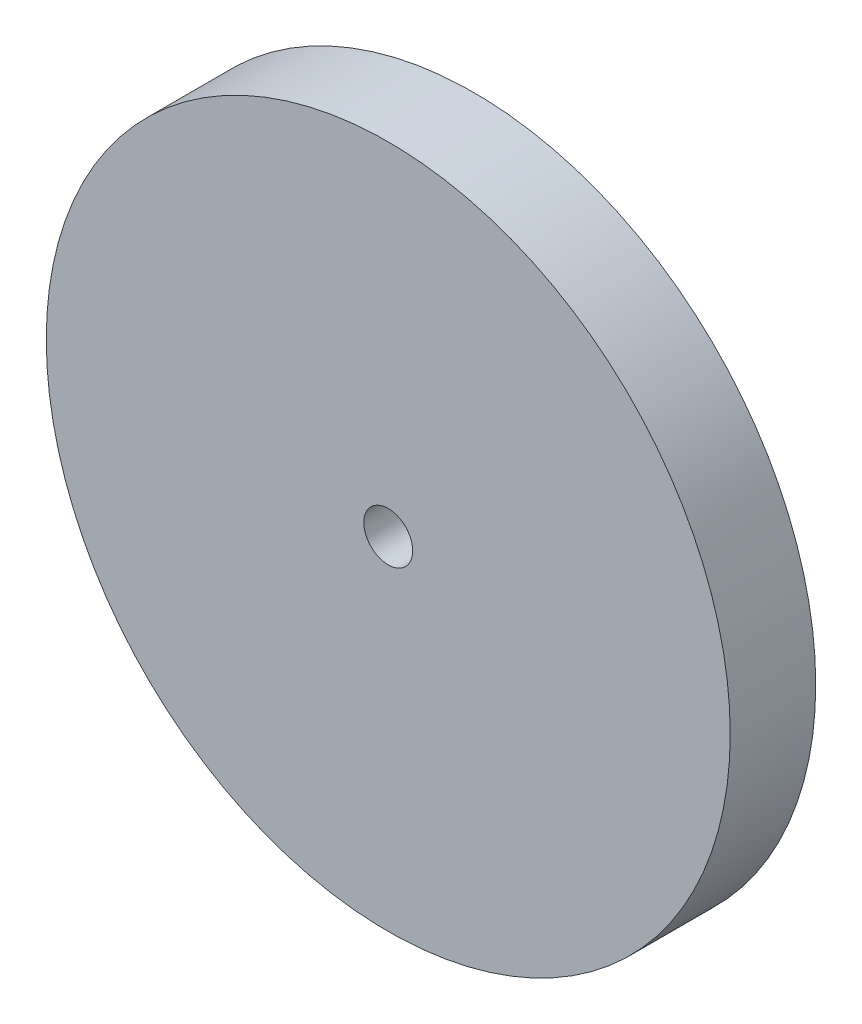
ISO-10303-21;
HEADER;
FILE_DESCRIPTION(('STEP AP214'),'2;1');
FILE_NAME('part.step','',(''),(''),'','','');
FILE_SCHEMA(('AUTOMOTIVE_DESIGN { 1 0 10303 214 1 1 1 1 }'));
ENDSEC;
DATA;
#1=APPLICATION_CONTEXT('core data for automotive mechanical design processes');
#2=APPLICATION_PROTOCOL_DEFINITION('international standard','automotive_design',2000,#1);
#3=PRODUCT_CONTEXT('',#1,'mechanical');
#4=PRODUCT('Part','Part','',(#3));
#5=PRODUCT_RELATED_PRODUCT_CATEGORY('part','',(#4));
#6=PRODUCT_DEFINITION_FORMATION('','',#4);
#7=PRODUCT_DEFINITION_CONTEXT('part definition',#1,'design');
#8=PRODUCT_DEFINITION('design','',#6,#7);
#9=PRODUCT_DEFINITION_SHAPE('','',#8);
#10=(LENGTH_UNIT() NAMED_UNIT(*) SI_UNIT(.MILLI.,.METRE.));
#11=(NAMED_UNIT(*) PLANE_ANGLE_UNIT() SI_UNIT($,.RADIAN.));
#12=(NAMED_UNIT(*) SI_UNIT($,.STERADIAN.) SOLID_ANGLE_UNIT());
#13=UNCERTAINTY_MEASURE_WITH_UNIT(LENGTH_MEASURE(1.E-05),#10,'distance_accuracy_value','');
#14=(GEOMETRIC_REPRESENTATION_CONTEXT(3) GLOBAL_UNCERTAINTY_ASSIGNED_CONTEXT((#13)) GLOBAL_UNIT_ASSIGNED_CONTEXT((#10,
#11,#12)) REPRESENTATION_CONTEXT('',''));
#15=CARTESIAN_POINT('',(0.,0.,0.));
#16=DIRECTION('',(0.,0.,1.));
#17=DIRECTION('',(1.,0.,0.));
#18=AXIS2_PLACEMENT_3D('',#15,#16,#17);
#19=CARTESIAN_POINT('',(0.,0.,3.5));
#20=DIRECTION('',(0.,0.,1.));
#21=DIRECTION('',(1.,0.,0.));
#22=AXIS2_PLACEMENT_3D('',#19,#20,#21);
#23=PLANE('',#22);
#24=CARTESIAN_POINT('',(0.,0.,3.5));
#25=DIRECTION('',(0.,0.,1.));
#26=DIRECTION('',(1.,0.,0.));
#27=AXIS2_PLACEMENT_3D('',#24,#25,#26);
#28=CIRCLE('',#27,14.);
#29=CARTESIAN_POINT('',(14.,0.,3.5));
#30=VERTEX_POINT('',#29);
#31=EDGE_CURVE('E10',#30,#30,#28,.T.);
#32=ORIENTED_EDGE('',*,*,#31,.T.);
#33=EDGE_LOOP('',(#32));
#34=FACE_BOUND('',#33,.T.);
#35=CARTESIAN_POINT('',(0.,0.,3.5));
#36=DIRECTION('',(0.,0.,1.));
#37=DIRECTION('',(1.,0.,0.));
#38=AXIS2_PLACEMENT_3D('',#35,#36,#37);
#39=CIRCLE('',#38,1.);
#40=CARTESIAN_POINT('',(1.,0.,3.5));
#41=VERTEX_POINT('',#40);
#42=EDGE_CURVE('E50',#41,#41,#39,.T.);
#43=ORIENTED_EDGE('',*,*,#42,.F.);
#44=EDGE_LOOP('',(#43));
#45=FACE_BOUND('',#44,.T.);
#46=ADVANCED_FACE('F37',(#34,#45),#23,.T.);
#47=CARTESIAN_POINT('',(0.,0.,0.));
#48=DIRECTION('',(0.,0.,1.));
#49=DIRECTION('',(1.,0.,0.));
#50=AXIS2_PLACEMENT_3D('',#47,#48,#49);
#51=PLANE('',#50);
#52=CARTESIAN_POINT('',(0.,0.,0.));
#53=DIRECTION('',(0.,0.,1.));
#54=DIRECTION('',(1.,0.,0.));
#55=AXIS2_PLACEMENT_3D('',#52,#53,#54);
#56=CIRCLE('',#55,14.);
#57=CARTESIAN_POINT('',(14.,0.,0.));
#58=VERTEX_POINT('',#57);
#59=EDGE_CURVE('E41',#58,#58,#56,.T.);
#60=ORIENTED_EDGE('',*,*,#59,.F.);
#61=EDGE_LOOP('',(#60));
#62=FACE_BOUND('',#61,.T.);
#63=CARTESIAN_POINT('',(0.,0.,0.));
#64=DIRECTION('',(0.,0.,1.));
#65=DIRECTION('',(1.,0.,0.));
#66=AXIS2_PLACEMENT_3D('',#63,#64,#65);
#67=CIRCLE('',#66,1.);
#68=CARTESIAN_POINT('',(1.,0.,0.));
#69=VERTEX_POINT('',#68);
#70=EDGE_CURVE('E52',#69,#69,#67,.T.);
#71=ORIENTED_EDGE('',*,*,#70,.T.);
#72=EDGE_LOOP('',(#71));
#73=FACE_BOUND('',#72,.T.);
#74=ADVANCED_FACE('F64',(#62,#73),#51,.F.);
#75=CARTESIAN_POINT('',(0.,0.,3.5));
#76=DIRECTION('',(0.,0.,-1.));
#77=DIRECTION('',(-1.,0.,0.));
#78=AXIS2_PLACEMENT_3D('',#75,#76,#77);
#79=CYLINDRICAL_SURFACE('',#78,14.);
#80=ORIENTED_EDGE('',*,*,#31,.F.);
#81=EDGE_LOOP('',(#80));
#82=FACE_BOUND('',#81,.T.);
#83=ORIENTED_EDGE('',*,*,#59,.T.);
#84=EDGE_LOOP('',(#83));
#85=FACE_BOUND('',#84,.T.);
#86=ADVANCED_FACE('F39',(#82,#85),#79,.T.);
#87=CARTESIAN_POINT('',(0.,0.,3.5));
#88=DIRECTION('',(0.,0.,-1.));
#89=DIRECTION('',(-1.,0.,0.));
#90=AXIS2_PLACEMENT_3D('',#87,#88,#89);
#91=CYLINDRICAL_SURFACE('',#90,1.);
#92=ORIENTED_EDGE('',*,*,#42,.T.);
#93=EDGE_LOOP('',(#92));
#94=FACE_BOUND('',#93,.T.);
#95=ORIENTED_EDGE('',*,*,#70,.F.);
#96=EDGE_LOOP('',(#95));
#97=FACE_BOUND('',#96,.T.);
#98=ADVANCED_FACE('F60',(#94,#97),#91,.F.);
#99=CLOSED_SHELL('',(#46,#74,#86,#98));
#100=MANIFOLD_SOLID_BREP('B2',#99);
#101=ADVANCED_BREP_SHAPE_REPRESENTATION('',(#18,#100),#14);
#102=SHAPE_DEFINITION_REPRESENTATION(#9,#101);
ENDSEC;
END-ISO-10303-21;
